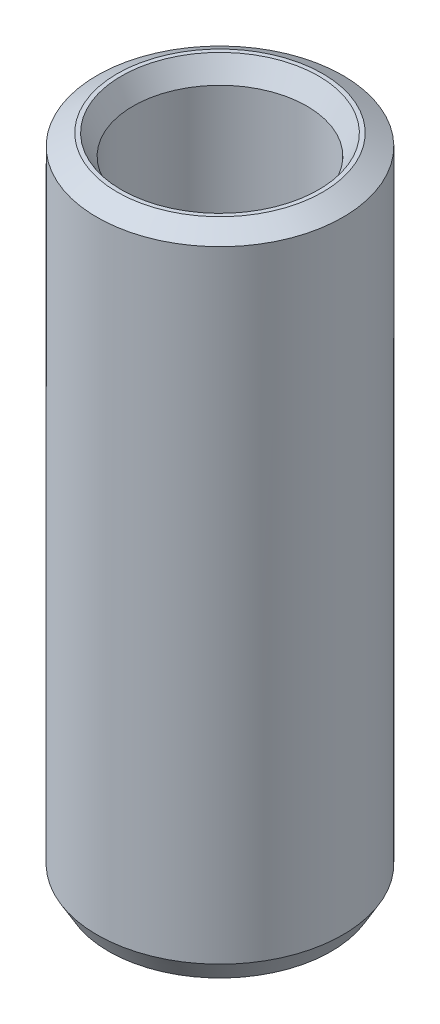
ISO-10303-21;
HEADER;
FILE_DESCRIPTION(('STEP AP214'),'2;1');
FILE_NAME('part.step','',(''),(''),'','','');
FILE_SCHEMA(('AUTOMOTIVE_DESIGN { 1 0 10303 214 1 1 1 1 }'));
ENDSEC;
DATA;
#1=APPLICATION_CONTEXT('core data for automotive mechanical design processes');
#2=APPLICATION_PROTOCOL_DEFINITION('international standard','automotive_design',2000,#1);
#3=PRODUCT_CONTEXT('',#1,'mechanical');
#4=PRODUCT('Part','Part','',(#3));
#5=PRODUCT_RELATED_PRODUCT_CATEGORY('part','',(#4));
#6=PRODUCT_DEFINITION_FORMATION('','',#4);
#7=PRODUCT_DEFINITION_CONTEXT('part definition',#1,'design');
#8=PRODUCT_DEFINITION('design','',#6,#7);
#9=PRODUCT_DEFINITION_SHAPE('','',#8);
#10=(LENGTH_UNIT() NAMED_UNIT(*) SI_UNIT(.MILLI.,.METRE.));
#11=(NAMED_UNIT(*) PLANE_ANGLE_UNIT() SI_UNIT($,.RADIAN.));
#12=(NAMED_UNIT(*) SI_UNIT($,.STERADIAN.) SOLID_ANGLE_UNIT());
#13=UNCERTAINTY_MEASURE_WITH_UNIT(LENGTH_MEASURE(1.E-05),#10,'distance_accuracy_value','');
#14=(GEOMETRIC_REPRESENTATION_CONTEXT(3) GLOBAL_UNCERTAINTY_ASSIGNED_CONTEXT((#13)) GLOBAL_UNIT_ASSIGNED_CONTEXT((#10,
#11,#12)) REPRESENTATION_CONTEXT('',''));
#15=CARTESIAN_POINT('',(0.,0.,0.));
#16=DIRECTION('',(0.,0.,1.));
#17=DIRECTION('',(1.,0.,0.));
#18=AXIS2_PLACEMENT_3D('',#15,#16,#17);
#19=CARTESIAN_POINT('',(0.,159.432788918214,0.));
#20=DIRECTION('',(0.,-1.,0.));
#21=DIRECTION('',(0.,0.,-1.));
#22=AXIS2_PLACEMENT_3D('',#19,#20,#21);
#23=CYLINDRICAL_SURFACE('',#22,30.);
#24=CARTESIAN_POINT('',(0.,4.93401569578575,0.));
#25=DIRECTION('',(0.,1.,0.));
#26=DIRECTION('',(0.,0.,1.));
#27=AXIS2_PLACEMENT_3D('',#24,#25,#26);
#28=CIRCLE('',#27,30.);
#29=CARTESIAN_POINT('',(0.,4.93401569578575,-30.));
#30=VERTEX_POINT('',#29);
#31=EDGE_CURVE('E10',#30,#30,#28,.T.);
#32=CARTESIAN_POINT('',(0.,156.584133628067,0.));
#33=DIRECTION('',(0.,1.,0.));
#34=DIRECTION('',(0.,0.,1.));
#35=AXIS2_PLACEMENT_3D('',#32,#33,#34);
#36=CIRCLE('',#35,30.);
#37=CARTESIAN_POINT('',(0.,156.584133628067,-30.));
#38=VERTEX_POINT('',#37);
#39=EDGE_CURVE('E50',#38,#38,#36,.F.);
#40=CARTESIAN_POINT('',(0.,4.93401569578575,-30.));
#41=CARTESIAN_POINT('',(0.,6.51370442424701,-30.));
#42=CARTESIAN_POINT('',(0.,8.09339315270827,-30.));
#43=CARTESIAN_POINT('',(0.,11.2527706096308,-30.));
#44=CARTESIAN_POINT('',(0.,12.832459338092,-30.));
#45=CARTESIAN_POINT('',(0.,15.9918367950146,-30.));
#46=CARTESIAN_POINT('',(0.,17.5715255234758,-30.));
#47=CARTESIAN_POINT('',(0.,20.7309029803983,-30.));
#48=CARTESIAN_POINT('',(0.,22.3105917088596,-30.));
#49=CARTESIAN_POINT('',(0.,25.4699691657821,-30.));
#50=CARTESIAN_POINT('',(0.,27.0496578942434,-30.));
#51=CARTESIAN_POINT('',(0.,30.2090353511659,-30.));
#52=CARTESIAN_POINT('',(0.,31.7887240796272,-30.));
#53=CARTESIAN_POINT('',(0.,34.9481015365497,-30.));
#54=CARTESIAN_POINT('',(0.,36.5277902650109,-30.));
#55=CARTESIAN_POINT('',(0.,39.6871677219334,-30.));
#56=CARTESIAN_POINT('',(0.,41.2668564503947,-30.));
#57=CARTESIAN_POINT('',(0.,44.4262339073172,-30.));
#58=CARTESIAN_POINT('',(0.,46.0059226357785,-30.));
#59=CARTESIAN_POINT('',(0.,49.165300092701,-30.));
#60=CARTESIAN_POINT('',(0.,50.7449888211623,-30.));
#61=CARTESIAN_POINT('',(0.,53.9043662780848,-30.));
#62=CARTESIAN_POINT('',(0.,55.484055006546,-30.));
#63=CARTESIAN_POINT('',(0.,58.6434324634686,-30.));
#64=CARTESIAN_POINT('',(0.,60.2231211919298,-30.));
#65=CARTESIAN_POINT('',(0.,63.3824986488523,-30.));
#66=CARTESIAN_POINT('',(0.,64.9621873773136,-30.));
#67=CARTESIAN_POINT('',(0.,68.1215648342361,-30.));
#68=CARTESIAN_POINT('',(0.,69.7012535626974,-30.));
#69=CARTESIAN_POINT('',(0.,72.8606310196199,-30.));
#70=CARTESIAN_POINT('',(0.,74.4403197480812,-30.));
#71=CARTESIAN_POINT('',(0.,77.5996972050037,-30.));
#72=CARTESIAN_POINT('',(0.,79.1793859334649,-30.));
#73=CARTESIAN_POINT('',(0.,82.3387633903875,-30.));
#74=CARTESIAN_POINT('',(0.,83.9184521188487,-30.));
#75=CARTESIAN_POINT('',(0.,87.0778295757712,-30.));
#76=CARTESIAN_POINT('',(0.,88.6575183042325,-30.));
#77=CARTESIAN_POINT('',(0.,91.816895761155,-30.));
#78=CARTESIAN_POINT('',(0.,93.3965844896163,-30.));
#79=CARTESIAN_POINT('',(0.,96.5559619465388,-30.));
#80=CARTESIAN_POINT('',(0.,98.1356506750001,-30.));
#81=CARTESIAN_POINT('',(0.,101.295028131923,-30.));
#82=CARTESIAN_POINT('',(0.,102.874716860384,-30.));
#83=CARTESIAN_POINT('',(0.,106.034094317306,-30.));
#84=CARTESIAN_POINT('',(0.,107.613783045768,-30.));
#85=CARTESIAN_POINT('',(0.,110.77316050269,-30.));
#86=CARTESIAN_POINT('',(0.,112.352849231151,-30.));
#87=CARTESIAN_POINT('',(0.,115.512226688074,-30.));
#88=CARTESIAN_POINT('',(0.,117.091915416535,-30.));
#89=CARTESIAN_POINT('',(0.,120.251292873458,-30.));
#90=CARTESIAN_POINT('',(0.,121.830981601919,-30.));
#91=CARTESIAN_POINT('',(0.,124.990359058841,-30.));
#92=CARTESIAN_POINT('',(0.,126.570047787303,-30.));
#93=CARTESIAN_POINT('',(0.,129.729425244225,-30.));
#94=CARTESIAN_POINT('',(0.,131.309113972687,-30.));
#95=CARTESIAN_POINT('',(0.,134.468491429609,-30.));
#96=CARTESIAN_POINT('',(0.,136.04818015807,-30.));
#97=CARTESIAN_POINT('',(0.,139.207557614993,-30.));
#98=CARTESIAN_POINT('',(0.,140.787246343454,-30.));
#99=CARTESIAN_POINT('',(0.,143.946623800377,-30.));
#100=CARTESIAN_POINT('',(0.,145.526312528838,-30.));
#101=CARTESIAN_POINT('',(0.,148.68568998576,-30.));
#102=CARTESIAN_POINT('',(0.,150.265378714222,-30.));
#103=CARTESIAN_POINT('',(0.,153.424756171144,-30.));
#104=CARTESIAN_POINT('',(0.,155.004444899605,-30.));
#105=CARTESIAN_POINT('',(0.,156.584133628067,-30.));
#106=B_SPLINE_CURVE_WITH_KNOTS('',3,(#40,#41,#42,#43,#44,#45,#46,#47,#48,#49,#50,#51,#52,#53,
#54,#55,#56,#57,#58,#59,#60,#61,#62,#63,#64,#65,#66,#67,#68,#69,#70,#71,#72,#73,#74,#75,#76,#77,
#78,#79,#80,#81,#82,#83,#84,#85,#86,#87,#88,#89,#90,#91,#92,#93,#94,#95,#96,#97,#98,#99,#100,
#101,#102,#103,#104,#105),.UNSPECIFIED.,.F.,.F.,(4,2,2,2,2,2,2,2,2,2,2,2,2,2,2,2,2,2,2,2,2,2,2,
2,2,2,2,2,2,2,2,2,4),(0.,4.73906618538378,9.47813237076756,14.2171985561513,18.9562647415351,
23.6953309269189,28.4343971123027,33.1734632976864,37.9125294830702,42.651595668454,
47.3906618538378,52.1297280392215,56.8687942246053,61.6078604099891,66.3469265953729,
71.0859927807567,75.8250589661404,80.5641251515242,85.303191336908,90.0422575222918,
94.7813237076756,99.5203898930593,104.259456078443,108.998522263827,113.737588449211,
118.476654634594,123.215720819978,127.954787005362,132.693853190746,137.43291937613,
142.171985561513,146.911051746897,151.650117932281),.UNSPECIFIED.);
#107=EDGE_CURVE('BSEAM39',#30,#38,#106,.T.);
#108=ORIENTED_EDGE('',*,*,#31,.T.);
#109=ORIENTED_EDGE('',*,*,#39,.T.);
#110=ORIENTED_EDGE('',*,*,#107,.T.);
#111=ORIENTED_EDGE('',*,*,#107,.F.);
#112=EDGE_LOOP('',(#108,#110,#109,#111));
#113=FACE_BOUND('',#112,.T.);
#114=ADVANCED_FACE('F39',(#113),#23,.T.);
#115=CARTESIAN_POINT('',(0.,159.432788918214,0.));
#116=DIRECTION('',(0.,1.,0.));
#117=DIRECTION('',(0.,0.,1.));
#118=AXIS2_PLACEMENT_3D('',#115,#116,#117);
#119=PLANE('',#118);
#120=CARTESIAN_POINT('',(0.,159.432788918214,0.));
#121=DIRECTION('',(0.,1.,0.));
#122=DIRECTION('',(0.,0.,1.));
#123=AXIS2_PLACEMENT_3D('',#120,#121,#122);
#124=CIRCLE('',#123,24.0630558534333);
#125=CARTESIAN_POINT('',(0.,159.432788918214,24.0630558534333));
#126=VERTEX_POINT('',#125);
#127=EDGE_CURVE('E58',#126,#126,#124,.F.);
#128=ORIENTED_EDGE('',*,*,#127,.T.);
#129=EDGE_LOOP('',(#128));
#130=FACE_BOUND('',#129,.T.);
#131=CARTESIAN_POINT('',(0.,159.432788918214,0.));
#132=DIRECTION('',(0.,1.,0.));
#133=DIRECTION('',(0.,0.,1.));
#134=AXIS2_PLACEMENT_3D('',#131,#132,#133);
#135=CIRCLE('',#134,25.0659843042148);
#136=CARTESIAN_POINT('',(0.,159.432788918214,25.0659843042148));
#137=VERTEX_POINT('',#136);
#138=EDGE_CURVE('E61',#137,#137,#135,.T.);
#139=ORIENTED_EDGE('',*,*,#138,.T.);
#140=EDGE_LOOP('',(#139));
#141=FACE_BOUND('',#140,.T.);
#142=ADVANCED_FACE('F88',(#130,#141),#119,.T.);
#143=CARTESIAN_POINT('',(0.,0.,0.));
#144=DIRECTION('',(0.,1.,0.));
#145=DIRECTION('',(0.,0.,1.));
#146=AXIS2_PLACEMENT_3D('',#143,#144,#145);
#147=PLANE('',#146);
#148=CARTESIAN_POINT('',(0.,0.,0.));
#149=DIRECTION('',(0.,1.,0.));
#150=DIRECTION('',(0.,0.,1.));
#151=AXIS2_PLACEMENT_3D('',#148,#149,#150);
#152=CIRCLE('',#151,26.1484162590709);
#153=CARTESIAN_POINT('',(0.,0.,-26.1484162590709));
#154=VERTEX_POINT('',#153);
#155=EDGE_CURVE('E51',#154,#154,#152,.T.);
#156=ORIENTED_EDGE('',*,*,#155,.T.);
#157=EDGE_LOOP('',(#156));
#158=FACE_BOUND('',#157,.T.);
#159=CARTESIAN_POINT('',(0.,0.,0.));
#160=DIRECTION('',(0.,1.,0.));
#161=DIRECTION('',(0.,0.,1.));
#162=AXIS2_PLACEMENT_3D('',#159,#160,#161);
#163=CIRCLE('',#162,27.1513447098522);
#164=CARTESIAN_POINT('',(0.,0.,27.1513447098522));
#165=VERTEX_POINT('',#164);
#166=EDGE_CURVE('E54',#165,#165,#163,.F.);
#167=ORIENTED_EDGE('',*,*,#166,.T.);
#168=EDGE_LOOP('',(#167));
#169=FACE_BOUND('',#168,.T.);
#170=ADVANCED_FACE('F83',(#158,#169),#147,.F.);
#171=CARTESIAN_POINT('',(0.,159.432788918214,0.));
#172=DIRECTION('',(0.,-1.,0.));
#173=DIRECTION('',(0.,0.,-1.));
#174=AXIS2_PLACEMENT_3D('',#171,#172,#173);
#175=CYLINDRICAL_SURFACE('',#174,21.2144005632856);
#176=CARTESIAN_POINT('',(0.,154.498773222428,0.));
#177=DIRECTION('',(0.,1.,0.));
#178=DIRECTION('',(0.,0.,1.));
#179=AXIS2_PLACEMENT_3D('',#176,#177,#178);
#180=CIRCLE('',#179,21.2144005632856);
#181=CARTESIAN_POINT('',(0.,154.498773222428,-21.2144005632856));
#182=VERTEX_POINT('',#181);
#183=EDGE_CURVE('E67',#182,#182,#180,.T.);
#184=CARTESIAN_POINT('',(0.,2.84865529014752,0.));
#185=DIRECTION('',(0.,1.,0.));
#186=DIRECTION('',(0.,0.,1.));
#187=AXIS2_PLACEMENT_3D('',#184,#185,#186);
#188=CIRCLE('',#187,21.2144005632856);
#189=CARTESIAN_POINT('',(0.,2.84865529014752,-21.2144005632856));
#190=VERTEX_POINT('',#189);
#191=EDGE_CURVE('E69',#190,#190,#188,.F.);
#192=CARTESIAN_POINT('',(0.,154.498773222428,-21.2144005632856));
#193=CARTESIAN_POINT('',(0.,152.919084493967,-21.2144005632856));
#194=CARTESIAN_POINT('',(0.,151.339395765506,-21.2144005632856));
#195=CARTESIAN_POINT('',(0.,148.180018308583,-21.2144005632856));
#196=CARTESIAN_POINT('',(0.,146.600329580122,-21.2144005632856));
#197=CARTESIAN_POINT('',(0.,143.4409521232,-21.2144005632856));
#198=CARTESIAN_POINT('',(0.,141.861263394738,-21.2144005632856));
#199=CARTESIAN_POINT('',(0.,138.701885937816,-21.2144005632856));
#200=CARTESIAN_POINT('',(0.,137.122197209355,-21.2144005632856));
#201=CARTESIAN_POINT('',(0.,133.962819752432,-21.2144005632856));
#202=CARTESIAN_POINT('',(0.,132.383131023971,-21.2144005632856));
#203=CARTESIAN_POINT('',(0.,129.223753567048,-21.2144005632856));
#204=CARTESIAN_POINT('',(0.,127.644064838587,-21.2144005632856));
#205=CARTESIAN_POINT('',(0.,124.484687381665,-21.2144005632856));
#206=CARTESIAN_POINT('',(0.,122.904998653203,-21.2144005632856));
#207=CARTESIAN_POINT('',(0.,119.745621196281,-21.2144005632856));
#208=CARTESIAN_POINT('',(0.,118.16593246782,-21.2144005632856));
#209=CARTESIAN_POINT('',(0.,115.006555010897,-21.2144005632856));
#210=CARTESIAN_POINT('',(0.,113.426866282436,-21.2144005632856));
#211=CARTESIAN_POINT('',(0.,110.267488825513,-21.2144005632856));
#212=CARTESIAN_POINT('',(0.,108.687800097052,-21.2144005632856));
#213=CARTESIAN_POINT('',(0.,105.528422640129,-21.2144005632856));
#214=CARTESIAN_POINT('',(0.,103.948733911668,-21.2144005632856));
#215=CARTESIAN_POINT('',(0.,100.789356454746,-21.2144005632856));
#216=CARTESIAN_POINT('',(0.,99.2096677262844,-21.2144005632856));
#217=CARTESIAN_POINT('',(0.,96.0502902693619,-21.2144005632856));
#218=CARTESIAN_POINT('',(0.,94.4706015409006,-21.2144005632856));
#219=CARTESIAN_POINT('',(0.,91.3112240839781,-21.2144005632856));
#220=CARTESIAN_POINT('',(0.,89.7315353555168,-21.2144005632856));
#221=CARTESIAN_POINT('',(0.,86.5721578985943,-21.2144005632856));
#222=CARTESIAN_POINT('',(0.,84.992469170133,-21.2144005632856));
#223=CARTESIAN_POINT('',(0.,81.8330917132105,-21.2144005632856));
#224=CARTESIAN_POINT('',(0.,80.2534029847493,-21.2144005632856));
#225=CARTESIAN_POINT('',(0.,77.0940255278267,-21.2144005632856));
#226=CARTESIAN_POINT('',(0.,75.5143367993655,-21.2144005632856));
#227=CARTESIAN_POINT('',(0.,72.354959342443,-21.2144005632856));
#228=CARTESIAN_POINT('',(0.,70.7752706139817,-21.2144005632856));
#229=CARTESIAN_POINT('',(0.,67.6158931570592,-21.2144005632856));
#230=CARTESIAN_POINT('',(0.,66.0362044285979,-21.2144005632856));
#231=CARTESIAN_POINT('',(0.,62.8768269716754,-21.2144005632856));
#232=CARTESIAN_POINT('',(0.,61.2971382432141,-21.2144005632856));
#233=CARTESIAN_POINT('',(0.,58.1377607862916,-21.2144005632856));
#234=CARTESIAN_POINT('',(0.,56.5580720578304,-21.2144005632856));
#235=CARTESIAN_POINT('',(0.,53.3986946009078,-21.2144005632856));
#236=CARTESIAN_POINT('',(0.,51.8190058724466,-21.2144005632856));
#237=CARTESIAN_POINT('',(0.,48.6596284155241,-21.2144005632856));
#238=CARTESIAN_POINT('',(0.,47.0799396870628,-21.2144005632856));
#239=CARTESIAN_POINT('',(0.,43.9205622301403,-21.2144005632856));
#240=CARTESIAN_POINT('',(0.,42.340873501679,-21.2144005632856));
#241=CARTESIAN_POINT('',(0.,39.1814960447565,-21.2144005632856));
#242=CARTESIAN_POINT('',(0.,37.6018073162953,-21.2144005632856));
#243=CARTESIAN_POINT('',(0.,34.4424298593727,-21.2144005632856));
#244=CARTESIAN_POINT('',(0.,32.8627411309115,-21.2144005632856));
#245=CARTESIAN_POINT('',(0.,29.7033636739889,-21.2144005632856));
#246=CARTESIAN_POINT('',(0.,28.1236749455277,-21.2144005632856));
#247=CARTESIAN_POINT('',(0.,24.9642974886052,-21.2144005632856));
#248=CARTESIAN_POINT('',(0.,23.3846087601439,-21.2144005632856));
#249=CARTESIAN_POINT('',(0.,20.2252313032214,-21.2144005632856));
#250=CARTESIAN_POINT('',(0.,18.6455425747601,-21.2144005632856));
#251=CARTESIAN_POINT('',(0.,15.4861651178376,-21.2144005632856));
#252=CARTESIAN_POINT('',(0.,13.9064763893763,-21.2144005632856));
#253=CARTESIAN_POINT('',(0.,10.7470989324538,-21.2144005632856));
#254=CARTESIAN_POINT('',(0.,9.16741020399256,-21.2144005632856));
#255=CARTESIAN_POINT('',(0.,6.00803274707004,-21.2144005632856));
#256=CARTESIAN_POINT('',(0.,4.42834401860878,-21.2144005632856));
#257=CARTESIAN_POINT('',(0.,2.84865529014752,-21.2144005632856));
#258=B_SPLINE_CURVE_WITH_KNOTS('',3,(#192,#193,#194,#195,#196,#197,#198,#199,#200,#201,#202,
#203,#204,#205,#206,#207,#208,#209,#210,#211,#212,#213,#214,#215,#216,#217,#218,#219,#220,#221,
#222,#223,#224,#225,#226,#227,#228,#229,#230,#231,#232,#233,#234,#235,#236,#237,#238,#239,#240,
#241,#242,#243,#244,#245,#246,#247,#248,#249,#250,#251,#252,#253,#254,#255,#256,#257),
.UNSPECIFIED.,.F.,.F.,(4,2,2,2,2,2,2,2,2,2,2,2,2,2,2,2,2,2,2,2,2,2,2,2,2,2,2,2,2,2,2,2,4),(0.,
4.73906618538378,9.47813237076756,14.2171985561513,18.9562647415351,23.6953309269189,
28.4343971123027,33.1734632976864,37.9125294830702,42.651595668454,47.3906618538378,
52.1297280392216,56.8687942246053,61.6078604099891,66.3469265953729,71.0859927807567,
75.8250589661405,80.5641251515242,85.303191336908,90.0422575222918,94.7813237076756,
99.5203898930594,104.259456078443,108.998522263827,113.737588449211,118.476654634594,
123.215720819978,127.954787005362,132.693853190746,137.43291937613,142.171985561513,
146.911051746897,151.650117932281),.UNSPECIFIED.);
#259=EDGE_CURVE('BSEAM71',#182,#190,#258,.T.);
#260=ORIENTED_EDGE('',*,*,#183,.T.);
#261=ORIENTED_EDGE('',*,*,#191,.T.);
#262=ORIENTED_EDGE('',*,*,#259,.T.);
#263=ORIENTED_EDGE('',*,*,#259,.F.);
#264=EDGE_LOOP('',(#260,#262,#261,#263));
#265=FACE_BOUND('',#264,.T.);
#266=ADVANCED_FACE('F71',(#265),#175,.F.);
#267=CARTESIAN_POINT('',(0.,154.498773222428,0.));
#268=DIRECTION('',(0.,1.,0.));
#269=DIRECTION('',(0.,0.,1.));
#270=AXIS2_PLACEMENT_3D('',#267,#268,#269);
#271=CONICAL_SURFACE('',#270,21.2144005632856,0.5235987755983);
#272=ORIENTED_EDGE('',*,*,#127,.F.);
#273=EDGE_LOOP('',(#272));
#274=FACE_BOUND('',#273,.T.);
#275=ORIENTED_EDGE('',*,*,#183,.F.);
#276=EDGE_LOOP('',(#275));
#277=FACE_BOUND('',#276,.T.);
#278=ADVANCED_FACE('F77',(#274,#277),#271,.F.);
#279=CARTESIAN_POINT('',(0.,0.,0.));
#280=DIRECTION('',(0.,-1.,0.));
#281=DIRECTION('',(0.,0.,-1.));
#282=AXIS2_PLACEMENT_3D('',#279,#280,#281);
#283=CONICAL_SURFACE('',#282,26.1484162590709,1.04719755119659);
#284=CARTESIAN_POINT('',(0.,2.84865529014752,-21.2144005632855));
#285=CARTESIAN_POINT('',(0.,2.81898179754182,-21.2657965601166));
#286=CARTESIAN_POINT('',(0.,2.78930830493612,-21.3171925569477));
#287=CARTESIAN_POINT('',(0.,2.72996131972471,-21.4199845506099));
#288=CARTESIAN_POINT('',(0.,2.70028782711901,-21.471380547441));
#289=CARTESIAN_POINT('',(0.,2.6409408419076,-21.5741725411032));
#290=CARTESIAN_POINT('',(0.,2.6112673493019,-21.6255685379343));
#291=CARTESIAN_POINT('',(0.,2.55192036409049,-21.7283605315965));
#292=CARTESIAN_POINT('',(0.,2.52224687148479,-21.7797565284276));
#293=CARTESIAN_POINT('',(0.,2.46289988627338,-21.8825485220898));
#294=CARTESIAN_POINT('',(0.,2.43322639366767,-21.9339445189209));
#295=CARTESIAN_POINT('',(0.,2.37387940845627,-22.0367365125831));
#296=CARTESIAN_POINT('',(0.,2.34420591585057,-22.0881325094142));
#297=CARTESIAN_POINT('',(0.,2.28485893063916,-22.1909245030764));
#298=CARTESIAN_POINT('',(0.,2.25518543803345,-22.2423204999075));
#299=CARTESIAN_POINT('',(0.,2.19583845282205,-22.3451124935697));
#300=CARTESIAN_POINT('',(0.,2.16616496021634,-22.3965084904008));
#301=CARTESIAN_POINT('',(0.,2.10681797500494,-22.499300484063));
#302=CARTESIAN_POINT('',(0.,2.07714448239923,-22.5506964808941));
#303=CARTESIAN_POINT('',(0.,2.01779749718783,-22.6534884745563));
#304=CARTESIAN_POINT('',(0.,1.98812400458212,-22.7048844713874));
#305=CARTESIAN_POINT('',(0.,1.92877701937072,-22.8076764650496));
#306=CARTESIAN_POINT('',(0.,1.89910352676501,-22.8590724618807));
#307=CARTESIAN_POINT('',(0.,1.83975654155361,-22.9618644555428));
#308=CARTESIAN_POINT('',(0.,1.8100830489479,-23.0132604523739));
#309=CARTESIAN_POINT('',(0.,1.7507360637365,-23.1160524460361));
#310=CARTESIAN_POINT('',(0.,1.72106257113079,-23.1674484428672));
#311=CARTESIAN_POINT('',(0.,1.66171558591939,-23.2702404365294));
#312=CARTESIAN_POINT('',(0.,1.63204209331368,-23.3216364333605));
#313=CARTESIAN_POINT('',(0.,1.57269510810228,-23.4244284270227));
#314=CARTESIAN_POINT('',(0.,1.54302161549657,-23.4758244238538));
#315=CARTESIAN_POINT('',(0.,1.48367463028517,-23.578616417516));
#316=CARTESIAN_POINT('',(0.,1.45400113767946,-23.6300124143471));
#317=CARTESIAN_POINT('',(0.,1.39465415246806,-23.7328044080093));
#318=CARTESIAN_POINT('',(0.,1.36498065986235,-23.7842004048404));
#319=CARTESIAN_POINT('',(0.,1.30563367465095,-23.8869923985026));
#320=CARTESIAN_POINT('',(0.,1.27596018204524,-23.9383883953337));
#321=CARTESIAN_POINT('',(0.,1.21661319683384,-24.0411803889959));
#322=CARTESIAN_POINT('',(0.,1.18693970422813,-24.092576385827));
#323=CARTESIAN_POINT('',(0.,1.12759271901673,-24.1953683794892));
#324=CARTESIAN_POINT('',(0.,1.09791922641102,-24.2467643763203));
#325=CARTESIAN_POINT('',(0.,1.03857224119962,-24.3495563699825));
#326=CARTESIAN_POINT('',(0.,1.00889874859391,-24.4009523668136));
#327=CARTESIAN_POINT('',(0.,0.949551763382507,-24.5037443604757));
#328=CARTESIAN_POINT('',(0.,0.919878270776804,-24.5551403573069));
#329=CARTESIAN_POINT('',(0.,0.860531285565397,-24.657932350969));
#330=CARTESIAN_POINT('',(0.,0.830857792959694,-24.7093283478001));
#331=CARTESIAN_POINT('',(0.,0.771510807748287,-24.8121203414623));
#332=CARTESIAN_POINT('',(0.,0.741837315142584,-24.8635163382934));
#333=CARTESIAN_POINT('',(0.,0.682490329931177,-24.9663083319556));
#334=CARTESIAN_POINT('',(0.,0.652816837325474,-25.0177043287867));
#335=CARTESIAN_POINT('',(0.,0.593469852114067,-25.1204963224489));
#336=CARTESIAN_POINT('',(0.,0.563796359508364,-25.17189231928));
#337=CARTESIAN_POINT('',(0.,0.504449374296957,-25.2746843129422));
#338=CARTESIAN_POINT('',(0.,0.474775881691254,-25.3260803097733));
#339=CARTESIAN_POINT('',(0.,0.415428896479847,-25.4288723034355));
#340=CARTESIAN_POINT('',(0.,0.385755403874144,-25.4802683002666));
#341=CARTESIAN_POINT('',(0.,0.326408418662737,-25.5830602939288));
#342=CARTESIAN_POINT('',(0.,0.296734926057033,-25.6344562907599));
#343=CARTESIAN_POINT('',(0.,0.237387940845627,-25.7372482844221));
#344=CARTESIAN_POINT('',(0.,0.207714448239924,-25.7886442812532));
#345=CARTESIAN_POINT('',(0.,0.148367463028517,-25.8914362749154));
#346=CARTESIAN_POINT('',(0.,0.118693970422813,-25.9428322717465));
#347=CARTESIAN_POINT('',(0.,0.0593469852114062,-26.0456242654087));
#348=CARTESIAN_POINT('',(0.,0.0296734926057026,-26.0970202622398));
#349=CARTESIAN_POINT('',(0.,0.,-26.1484162590709));
#350=B_SPLINE_CURVE_WITH_KNOTS('',3,(#284,#285,#286,#287,#288,#289,#290,#291,#292,#293,#294,
#295,#296,#297,#298,#299,#300,#301,#302,#303,#304,#305,#306,#307,#308,#309,#310,#311,#312,#313,
#314,#315,#316,#317,#318,#319,#320,#321,#322,#323,#324,#325,#326,#327,#328,#329,#330,#331,#332,
#333,#334,#335,#336,#337,#338,#339,#340,#341,#342,#343,#344,#345,#346,#347,#348,#349),
.UNSPECIFIED.,.F.,.F.,(4,2,2,2,2,2,2,2,2,2,2,2,2,2,2,2,2,2,2,2,2,2,2,2,2,2,2,2,2,2,2,2,4),(0.,
0.178040955634219,0.356081911268438,0.534122866902654,0.712163822536873,0.890204778171092,
1.06824573380531,1.24628668943953,1.42432764507375,1.60236860070797,1.78040955634218,
1.9584505119764,2.13649146761062,2.31453242324484,2.49257337887906,2.67061433451328,
2.84865529014749,3.02669624578171,3.20473720141593,3.38277815705015,3.56081911268437,
3.73886006831859,3.91690102395281,4.09494197958702,4.27298293522124,4.45102389085546,
4.62906484648968,4.8071058021239,4.98514675775812,5.16318771339234,5.34122866902655,
5.51926962466077,5.69731058029499),.UNSPECIFIED.);
#351=EDGE_CURVE('BSEAM73',#190,#154,#350,.T.);
#352=ORIENTED_EDGE('',*,*,#191,.F.);
#353=ORIENTED_EDGE('',*,*,#155,.F.);
#354=ORIENTED_EDGE('',*,*,#351,.T.);
#355=ORIENTED_EDGE('',*,*,#351,.F.);
#356=EDGE_LOOP('',(#352,#354,#353,#355));
#357=FACE_BOUND('',#356,.T.);
#358=ADVANCED_FACE('F73',(#357),#283,.F.);
#359=CARTESIAN_POINT('',(0.,4.93401569578572,0.));
#360=DIRECTION('',(0.,1.,0.));
#361=DIRECTION('',(0.,0.,1.));
#362=AXIS2_PLACEMENT_3D('',#359,#360,#361);
#363=CONICAL_SURFACE('',#362,30.,0.523598775598303);
#364=ORIENTED_EDGE('',*,*,#166,.F.);
#365=EDGE_LOOP('',(#364));
#366=FACE_BOUND('',#365,.T.);
#367=ORIENTED_EDGE('',*,*,#31,.F.);
#368=EDGE_LOOP('',(#367));
#369=FACE_BOUND('',#368,.T.);
#370=ADVANCED_FACE('F76',(#366,#369),#363,.T.);
#371=CARTESIAN_POINT('',(0.,159.432788918214,0.));
#372=DIRECTION('',(0.,-1.,0.));
#373=DIRECTION('',(0.,0.,-1.));
#374=AXIS2_PLACEMENT_3D('',#371,#372,#373);
#375=CONICAL_SURFACE('',#374,25.0659843042148,1.0471975511966);
#376=ORIENTED_EDGE('',*,*,#39,.F.);
#377=EDGE_LOOP('',(#376));
#378=FACE_BOUND('',#377,.T.);
#379=ORIENTED_EDGE('',*,*,#138,.F.);
#380=EDGE_LOOP('',(#379));
#381=FACE_BOUND('',#380,.T.);
#382=ADVANCED_FACE('F45',(#378,#381),#375,.T.);
#383=CLOSED_SHELL('',(#114,#142,#170,#266,#278,#358,#370,#382));
#384=MANIFOLD_SOLID_BREP('B2',#383);
#385=ADVANCED_BREP_SHAPE_REPRESENTATION('',(#18,#384),#14);
#386=SHAPE_DEFINITION_REPRESENTATION(#9,#385);
ENDSEC;
END-ISO-10303-21;
